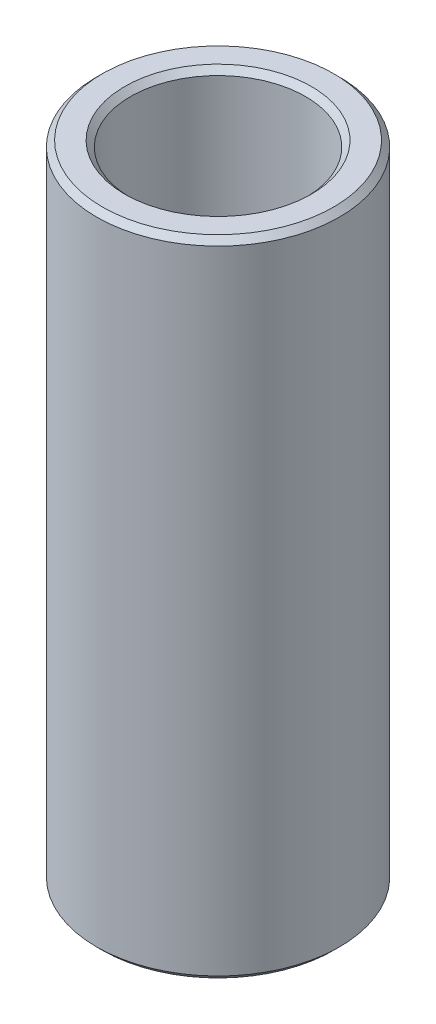
ISO-10303-21;
HEADER;
FILE_DESCRIPTION(('STEP AP214'),'2;1');
FILE_NAME('part.step','',(''),(''),'','','');
FILE_SCHEMA(('AUTOMOTIVE_DESIGN { 1 0 10303 214 1 1 1 1 }'));
ENDSEC;
DATA;
#1=APPLICATION_CONTEXT('core data for automotive mechanical design processes');
#2=APPLICATION_PROTOCOL_DEFINITION('international standard','automotive_design',2000,#1);
#3=PRODUCT_CONTEXT('',#1,'mechanical');
#4=PRODUCT('Part','Part','',(#3));
#5=PRODUCT_RELATED_PRODUCT_CATEGORY('part','',(#4));
#6=PRODUCT_DEFINITION_FORMATION('','',#4);
#7=PRODUCT_DEFINITION_CONTEXT('part definition',#1,'design');
#8=PRODUCT_DEFINITION('design','',#6,#7);
#9=PRODUCT_DEFINITION_SHAPE('','',#8);
#10=(LENGTH_UNIT() NAMED_UNIT(*) SI_UNIT(.MILLI.,.METRE.));
#11=(NAMED_UNIT(*) PLANE_ANGLE_UNIT() SI_UNIT($,.RADIAN.));
#12=(NAMED_UNIT(*) SI_UNIT($,.STERADIAN.) SOLID_ANGLE_UNIT());
#13=UNCERTAINTY_MEASURE_WITH_UNIT(LENGTH_MEASURE(1.E-05),#10,'distance_accuracy_value','');
#14=(GEOMETRIC_REPRESENTATION_CONTEXT(3) GLOBAL_UNCERTAINTY_ASSIGNED_CONTEXT((#13)) GLOBAL_UNIT_ASSIGNED_CONTEXT((#10,
#11,#12)) REPRESENTATION_CONTEXT('',''));
#15=CARTESIAN_POINT('',(0.,0.,0.));
#16=DIRECTION('',(0.,0.,1.));
#17=DIRECTION('',(1.,0.,0.));
#18=AXIS2_PLACEMENT_3D('',#15,#16,#17);
#19=CARTESIAN_POINT('',(0.,225.344528679117,0.));
#20=DIRECTION('',(0.,-1.,0.));
#21=DIRECTION('',(0.,0.,-1.));
#22=AXIS2_PLACEMENT_3D('',#19,#20,#21);
#23=CYLINDRICAL_SURFACE('',#22,42.5);
#24=CARTESIAN_POINT('',(0.,2.03179943909096,0.));
#25=DIRECTION('',(0.,1.,0.));
#26=DIRECTION('',(0.,0.,1.));
#27=AXIS2_PLACEMENT_3D('',#24,#25,#26);
#28=CIRCLE('',#27,42.5);
#29=CARTESIAN_POINT('',(0.,2.03179943909096,42.5));
#30=VERTEX_POINT('',#29);
#31=EDGE_CURVE('E10',#30,#30,#28,.T.);
#32=ORIENTED_EDGE('',*,*,#31,.T.);
#33=EDGE_LOOP('',(#32));
#34=FACE_BOUND('',#33,.T.);
#35=CARTESIAN_POINT('',(0.,223.312729240025,0.));
#36=DIRECTION('',(0.,1.,0.));
#37=DIRECTION('',(0.,0.,1.));
#38=AXIS2_PLACEMENT_3D('',#35,#36,#37);
#39=CIRCLE('',#38,42.5);
#40=CARTESIAN_POINT('',(0.,223.312729240025,42.5));
#41=VERTEX_POINT('',#40);
#42=EDGE_CURVE('E50',#41,#41,#39,.F.);
#43=ORIENTED_EDGE('',*,*,#42,.T.);
#44=EDGE_LOOP('',(#43));
#45=FACE_BOUND('',#44,.T.);
#46=ADVANCED_FACE('F39',(#34,#45),#23,.T.);
#47=CARTESIAN_POINT('',(0.,225.344528679117,0.));
#48=DIRECTION('',(0.,1.,0.));
#49=DIRECTION('',(0.,0.,1.));
#50=AXIS2_PLACEMENT_3D('',#47,#48,#49);
#51=PLANE('',#50);
#52=CARTESIAN_POINT('',(0.,225.344528679117,0.));
#53=DIRECTION('',(0.,1.,0.));
#54=DIRECTION('',(0.,0.,1.));
#55=AXIS2_PLACEMENT_3D('',#52,#53,#54);
#56=CIRCLE('',#55,32.6743860513616);
#57=CARTESIAN_POINT('',(0.,225.344528679117,32.6743860513616));
#58=VERTEX_POINT('',#57);
#59=EDGE_CURVE('E58',#58,#58,#56,.F.);
#60=ORIENTED_EDGE('',*,*,#59,.T.);
#61=EDGE_LOOP('',(#60));
#62=FACE_BOUND('',#61,.T.);
#63=CARTESIAN_POINT('',(0.,225.344528679117,0.));
#64=DIRECTION('',(0.,1.,0.));
#65=DIRECTION('',(0.,0.,1.));
#66=AXIS2_PLACEMENT_3D('',#63,#64,#65);
#67=CIRCLE('',#66,40.468200560909);
#68=CARTESIAN_POINT('',(0.,225.344528679117,40.468200560909));
#69=VERTEX_POINT('',#68);
#70=EDGE_CURVE('E61',#69,#69,#67,.T.);
#71=ORIENTED_EDGE('',*,*,#70,.T.);
#72=EDGE_LOOP('',(#71));
#73=FACE_BOUND('',#72,.T.);
#74=ADVANCED_FACE('F88',(#62,#73),#51,.T.);
#75=CARTESIAN_POINT('',(0.,0.,0.));
#76=DIRECTION('',(0.,1.,0.));
#77=DIRECTION('',(0.,0.,1.));
#78=AXIS2_PLACEMENT_3D('',#75,#76,#77);
#79=PLANE('',#78);
#80=CARTESIAN_POINT('',(0.,0.,0.));
#81=DIRECTION('',(0.,1.,0.));
#82=DIRECTION('',(0.,0.,1.));
#83=AXIS2_PLACEMENT_3D('',#80,#81,#82);
#84=CIRCLE('',#83,32.6743860513615);
#85=CARTESIAN_POINT('',(0.,0.,32.6743860513615));
#86=VERTEX_POINT('',#85);
#87=EDGE_CURVE('E51',#86,#86,#84,.T.);
#88=ORIENTED_EDGE('',*,*,#87,.T.);
#89=EDGE_LOOP('',(#88));
#90=FACE_BOUND('',#89,.T.);
#91=CARTESIAN_POINT('',(0.,0.,0.));
#92=DIRECTION('',(0.,1.,0.));
#93=DIRECTION('',(0.,0.,1.));
#94=AXIS2_PLACEMENT_3D('',#91,#92,#93);
#95=CIRCLE('',#94,40.468200560909);
#96=CARTESIAN_POINT('',(0.,0.,40.468200560909));
#97=VERTEX_POINT('',#96);
#98=EDGE_CURVE('E54',#97,#97,#95,.F.);
#99=ORIENTED_EDGE('',*,*,#98,.T.);
#100=EDGE_LOOP('',(#99));
#101=FACE_BOUND('',#100,.T.);
#102=ADVANCED_FACE('F83',(#90,#101),#79,.F.);
#103=CARTESIAN_POINT('',(0.,225.344528679117,0.));
#104=DIRECTION('',(0.,-1.,0.));
#105=DIRECTION('',(0.,0.,-1.));
#106=AXIS2_PLACEMENT_3D('',#103,#104,#105);
#107=CYLINDRICAL_SURFACE('',#106,30.6425866122705);
#108=CARTESIAN_POINT('',(0.,223.312729240025,0.));
#109=DIRECTION('',(0.,1.,0.));
#110=DIRECTION('',(0.,0.,1.));
#111=AXIS2_PLACEMENT_3D('',#108,#109,#110);
#112=CIRCLE('',#111,30.6425866122705);
#113=CARTESIAN_POINT('',(0.,223.312729240025,30.6425866122705));
#114=VERTEX_POINT('',#113);
#115=EDGE_CURVE('E67',#114,#114,#112,.T.);
#116=ORIENTED_EDGE('',*,*,#115,.T.);
#117=EDGE_LOOP('',(#116));
#118=FACE_BOUND('',#117,.T.);
#119=CARTESIAN_POINT('',(0.,2.03179943909101,0.));
#120=DIRECTION('',(0.,1.,0.));
#121=DIRECTION('',(0.,0.,1.));
#122=AXIS2_PLACEMENT_3D('',#119,#120,#121);
#123=CIRCLE('',#122,30.6425866122705);
#124=CARTESIAN_POINT('',(0.,2.03179943909101,30.6425866122705));
#125=VERTEX_POINT('',#124);
#126=EDGE_CURVE('E69',#125,#125,#123,.F.);
#127=ORIENTED_EDGE('',*,*,#126,.T.);
#128=EDGE_LOOP('',(#127));
#129=FACE_BOUND('',#128,.T.);
#130=ADVANCED_FACE('F71',(#118,#129),#107,.F.);
#131=CARTESIAN_POINT('',(0.,223.312729240025,0.));
#132=DIRECTION('',(0.,1.,0.));
#133=DIRECTION('',(0.,0.,1.));
#134=AXIS2_PLACEMENT_3D('',#131,#132,#133);
#135=CONICAL_SURFACE('',#134,30.6425866122705,0.78539816339745);
#136=ORIENTED_EDGE('',*,*,#59,.F.);
#137=EDGE_LOOP('',(#136));
#138=FACE_BOUND('',#137,.T.);
#139=ORIENTED_EDGE('',*,*,#115,.F.);
#140=EDGE_LOOP('',(#139));
#141=FACE_BOUND('',#140,.T.);
#142=ADVANCED_FACE('F77',(#138,#141),#135,.F.);
#143=CARTESIAN_POINT('',(0.,0.,0.));
#144=DIRECTION('',(0.,-1.,0.));
#145=DIRECTION('',(0.,0.,-1.));
#146=AXIS2_PLACEMENT_3D('',#143,#144,#145);
#147=CONICAL_SURFACE('',#146,32.6743860513615,0.785398163397436);
#148=ORIENTED_EDGE('',*,*,#126,.F.);
#149=EDGE_LOOP('',(#148));
#150=FACE_BOUND('',#149,.T.);
#151=ORIENTED_EDGE('',*,*,#87,.F.);
#152=EDGE_LOOP('',(#151));
#153=FACE_BOUND('',#152,.T.);
#154=ADVANCED_FACE('F73',(#150,#153),#147,.F.);
#155=CARTESIAN_POINT('',(0.,2.03179943909096,0.));
#156=DIRECTION('',(0.,1.,0.));
#157=DIRECTION('',(0.,0.,1.));
#158=AXIS2_PLACEMENT_3D('',#155,#156,#157);
#159=CONICAL_SURFACE('',#158,42.5,0.785398163397455);
#160=ORIENTED_EDGE('',*,*,#98,.F.);
#161=EDGE_LOOP('',(#160));
#162=FACE_BOUND('',#161,.T.);
#163=ORIENTED_EDGE('',*,*,#31,.F.);
#164=EDGE_LOOP('',(#163));
#165=FACE_BOUND('',#164,.T.);
#166=ADVANCED_FACE('F76',(#162,#165),#159,.T.);
#167=CARTESIAN_POINT('',(0.,225.344528679117,0.));
#168=DIRECTION('',(0.,-1.,0.));
#169=DIRECTION('',(0.,0.,-1.));
#170=AXIS2_PLACEMENT_3D('',#167,#168,#169);
#171=CONICAL_SURFACE('',#170,40.468200560909,0.785398163397435);
#172=ORIENTED_EDGE('',*,*,#42,.F.);
#173=EDGE_LOOP('',(#172));
#174=FACE_BOUND('',#173,.T.);
#175=ORIENTED_EDGE('',*,*,#70,.F.);
#176=EDGE_LOOP('',(#175));
#177=FACE_BOUND('',#176,.T.);
#178=ADVANCED_FACE('F45',(#174,#177),#171,.T.);
#179=CLOSED_SHELL('',(#46,#74,#102,#130,#142,#154,#166,#178));
#180=MANIFOLD_SOLID_BREP('B2',#179);
#181=ADVANCED_BREP_SHAPE_REPRESENTATION('',(#18,#180),#14);
#182=SHAPE_DEFINITION_REPRESENTATION(#9,#181);
ENDSEC;
END-ISO-10303-21;
